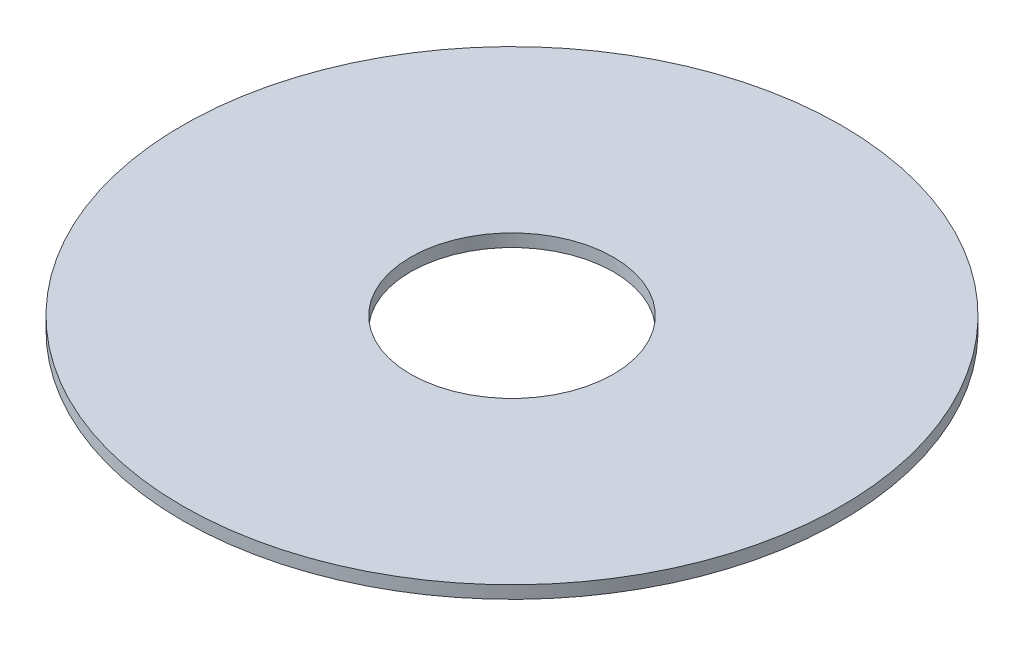
ISO-10303-21;
HEADER;
FILE_DESCRIPTION(('STEP AP214'),'2;1');
FILE_NAME('part.step','',(''),(''),'','','');
FILE_SCHEMA(('AUTOMOTIVE_DESIGN { 1 0 10303 214 1 1 1 1 }'));
ENDSEC;
DATA;
#1=APPLICATION_CONTEXT('core data for automotive mechanical design processes');
#2=APPLICATION_PROTOCOL_DEFINITION('international standard','automotive_design',2000,#1);
#3=PRODUCT_CONTEXT('',#1,'mechanical');
#4=PRODUCT('Part','Part','',(#3));
#5=PRODUCT_RELATED_PRODUCT_CATEGORY('part','',(#4));
#6=PRODUCT_DEFINITION_FORMATION('','',#4);
#7=PRODUCT_DEFINITION_CONTEXT('part definition',#1,'design');
#8=PRODUCT_DEFINITION('design','',#6,#7);
#9=PRODUCT_DEFINITION_SHAPE('','',#8);
#10=(LENGTH_UNIT() NAMED_UNIT(*) SI_UNIT(.MILLI.,.METRE.));
#11=(NAMED_UNIT(*) PLANE_ANGLE_UNIT() SI_UNIT($,.RADIAN.));
#12=(NAMED_UNIT(*) SI_UNIT($,.STERADIAN.) SOLID_ANGLE_UNIT());
#13=UNCERTAINTY_MEASURE_WITH_UNIT(LENGTH_MEASURE(1.E-05),#10,'distance_accuracy_value','');
#14=(GEOMETRIC_REPRESENTATION_CONTEXT(3) GLOBAL_UNCERTAINTY_ASSIGNED_CONTEXT((#13)) GLOBAL_UNIT_ASSIGNED_CONTEXT((#10,
#11,#12)) REPRESENTATION_CONTEXT('',''));
#15=CARTESIAN_POINT('',(0.,0.,0.));
#16=DIRECTION('',(0.,0.,1.));
#17=DIRECTION('',(1.,0.,0.));
#18=AXIS2_PLACEMENT_3D('',#15,#16,#17);
#19=CARTESIAN_POINT('',(0.,0.25,0.));
#20=DIRECTION('',(0.,1.,0.));
#21=DIRECTION('',(0.,0.,1.));
#22=AXIS2_PLACEMENT_3D('',#19,#20,#21);
#23=PLANE('',#22);
#24=CARTESIAN_POINT('',(0.,0.25,0.));
#25=DIRECTION('',(0.,1.,0.));
#26=DIRECTION('',(0.,0.,1.));
#27=AXIS2_PLACEMENT_3D('',#24,#25,#26);
#28=CIRCLE('',#27,6.5);
#29=CARTESIAN_POINT('',(0.,0.25,6.5));
#30=VERTEX_POINT('',#29);
#31=EDGE_CURVE('E10',#30,#30,#28,.T.);
#32=ORIENTED_EDGE('',*,*,#31,.T.);
#33=EDGE_LOOP('',(#32));
#34=FACE_BOUND('',#33,.T.);
#35=CARTESIAN_POINT('',(0.,0.25,0.));
#36=DIRECTION('',(0.,1.,0.));
#37=DIRECTION('',(0.,0.,1.));
#38=AXIS2_PLACEMENT_3D('',#35,#36,#37);
#39=CIRCLE('',#38,2.);
#40=CARTESIAN_POINT('',(0.,0.25,2.));
#41=VERTEX_POINT('',#40);
#42=EDGE_CURVE('E54',#41,#41,#39,.T.);
#43=ORIENTED_EDGE('',*,*,#42,.F.);
#44=EDGE_LOOP('',(#43));
#45=FACE_BOUND('',#44,.T.);
#46=ADVANCED_FACE('F43',(#34,#45),#23,.T.);
#47=CARTESIAN_POINT('',(0.,0.,0.));
#48=DIRECTION('',(0.,1.,0.));
#49=DIRECTION('',(0.,0.,1.));
#50=AXIS2_PLACEMENT_3D('',#47,#48,#49);
#51=PLANE('',#50);
#52=CARTESIAN_POINT('',(0.,0.,0.));
#53=DIRECTION('',(0.,1.,0.));
#54=DIRECTION('',(0.,0.,1.));
#55=AXIS2_PLACEMENT_3D('',#52,#53,#54);
#56=CIRCLE('',#55,6.5);
#57=CARTESIAN_POINT('',(0.,0.,6.5));
#58=VERTEX_POINT('',#57);
#59=EDGE_CURVE('E47',#58,#58,#56,.T.);
#60=ORIENTED_EDGE('',*,*,#59,.F.);
#61=EDGE_LOOP('',(#60));
#62=FACE_BOUND('',#61,.T.);
#63=CARTESIAN_POINT('',(0.,0.,0.));
#64=DIRECTION('',(0.,1.,0.));
#65=DIRECTION('',(0.,0.,1.));
#66=AXIS2_PLACEMENT_3D('',#63,#64,#65);
#67=CIRCLE('',#66,2.);
#68=CARTESIAN_POINT('',(0.,0.,2.));
#69=VERTEX_POINT('',#68);
#70=EDGE_CURVE('E56',#69,#69,#67,.T.);
#71=ORIENTED_EDGE('',*,*,#70,.T.);
#72=EDGE_LOOP('',(#71));
#73=FACE_BOUND('',#72,.T.);
#74=ADVANCED_FACE('F66',(#62,#73),#51,.F.);
#75=CARTESIAN_POINT('',(0.,0.25,0.));
#76=DIRECTION('',(0.,-1.,0.));
#77=DIRECTION('',(0.,0.,-1.));
#78=AXIS2_PLACEMENT_3D('',#75,#76,#77);
#79=CYLINDRICAL_SURFACE('',#78,6.5);
#80=ORIENTED_EDGE('',*,*,#31,.F.);
#81=EDGE_LOOP('',(#80));
#82=FACE_BOUND('',#81,.T.);
#83=ORIENTED_EDGE('',*,*,#59,.T.);
#84=EDGE_LOOP('',(#83));
#85=FACE_BOUND('',#84,.T.);
#86=ADVANCED_FACE('F45',(#82,#85),#79,.T.);
#87=CARTESIAN_POINT('',(0.,0.25,0.));
#88=DIRECTION('',(0.,-1.,0.));
#89=DIRECTION('',(0.,0.,-1.));
#90=AXIS2_PLACEMENT_3D('',#87,#88,#89);
#91=CYLINDRICAL_SURFACE('',#90,2.);
#92=ORIENTED_EDGE('',*,*,#42,.T.);
#93=EDGE_LOOP('',(#92));
#94=FACE_BOUND('',#93,.T.);
#95=ORIENTED_EDGE('',*,*,#70,.F.);
#96=EDGE_LOOP('',(#95));
#97=FACE_BOUND('',#96,.T.);
#98=ADVANCED_FACE('F62',(#94,#97),#91,.F.);
#99=CLOSED_SHELL('',(#46,#74,#86,#98));
#100=MANIFOLD_SOLID_BREP('B2',#99);
#101=ADVANCED_BREP_SHAPE_REPRESENTATION('',(#18,#100),#14);
#102=SHAPE_DEFINITION_REPRESENTATION(#9,#101);
ENDSEC;
END-ISO-10303-21;
